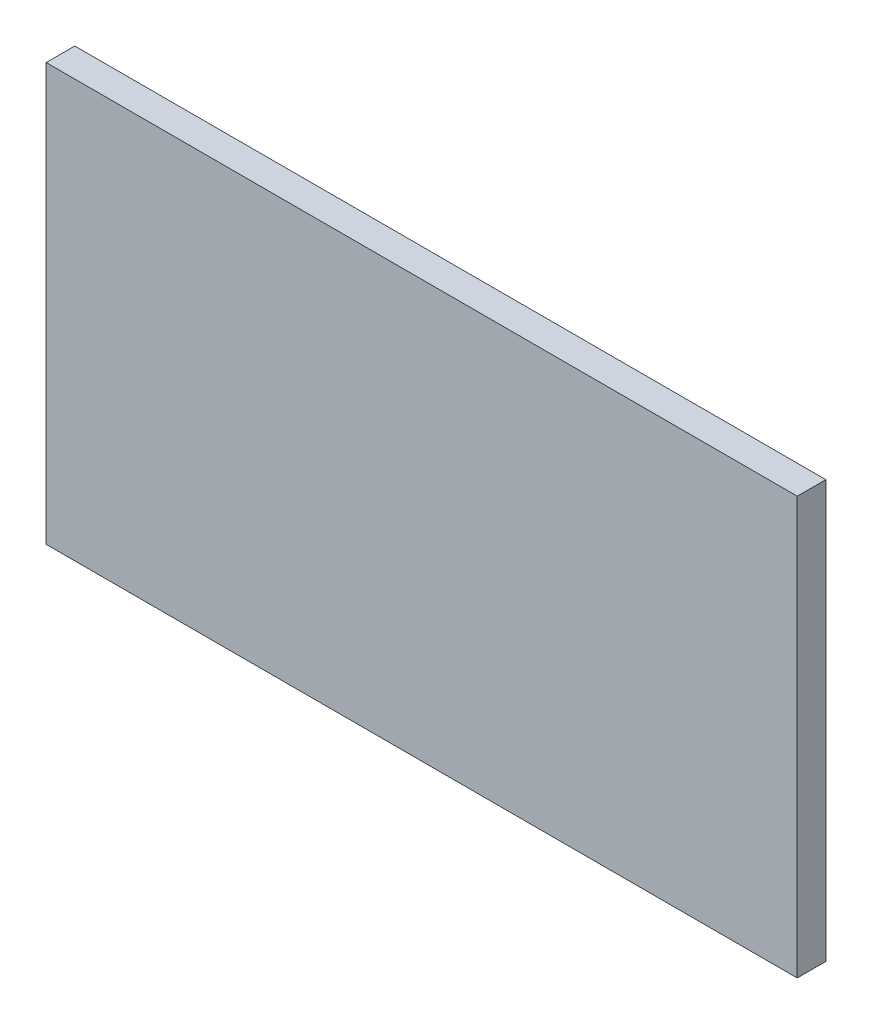
ISO-10303-21;
HEADER;
FILE_DESCRIPTION(('STEP AP214'),'2;1');
FILE_NAME('part.step','',(''),(''),'','','');
FILE_SCHEMA(('AUTOMOTIVE_DESIGN { 1 0 10303 214 1 1 1 1 }'));
ENDSEC;
DATA;
#1=APPLICATION_CONTEXT('core data for automotive mechanical design processes');
#2=APPLICATION_PROTOCOL_DEFINITION('international standard','automotive_design',2000,#1);
#3=PRODUCT_CONTEXT('',#1,'mechanical');
#4=PRODUCT('Part','Part','',(#3));
#5=PRODUCT_RELATED_PRODUCT_CATEGORY('part','',(#4));
#6=PRODUCT_DEFINITION_FORMATION('','',#4);
#7=PRODUCT_DEFINITION_CONTEXT('part definition',#1,'design');
#8=PRODUCT_DEFINITION('design','',#6,#7);
#9=PRODUCT_DEFINITION_SHAPE('','',#8);
#10=(LENGTH_UNIT() NAMED_UNIT(*) SI_UNIT(.MILLI.,.METRE.));
#11=(NAMED_UNIT(*) PLANE_ANGLE_UNIT() SI_UNIT($,.RADIAN.));
#12=(NAMED_UNIT(*) SI_UNIT($,.STERADIAN.) SOLID_ANGLE_UNIT());
#13=UNCERTAINTY_MEASURE_WITH_UNIT(LENGTH_MEASURE(1.E-05),#10,'distance_accuracy_value','');
#14=(GEOMETRIC_REPRESENTATION_CONTEXT(3) GLOBAL_UNCERTAINTY_ASSIGNED_CONTEXT((#13)) GLOBAL_UNIT_ASSIGNED_CONTEXT((#10,
#11,#12)) REPRESENTATION_CONTEXT('',''));
#15=CARTESIAN_POINT('',(0.,0.,0.));
#16=DIRECTION('',(0.,0.,1.));
#17=DIRECTION('',(1.,0.,0.));
#18=AXIS2_PLACEMENT_3D('',#15,#16,#17);
#19=CARTESIAN_POINT('',(12.50008,9.6,0.));
#20=DIRECTION('',(0.,0.,-1.));
#21=DIRECTION('',(-1.,0.,0.));
#22=AXIS2_PLACEMENT_3D('',#19,#20,#21);
#23=PLANE('',#22);
#24=DIRECTION('',(1.,0.,0.));
#25=VECTOR('',#24,1.);
#26=CARTESIAN_POINT('',(12.05008,9.85,0.));
#27=LINE('',#26,#25);
#28=CARTESIAN_POINT('',(12.05008,9.85,0.));
#29=VERTEX_POINT('',#28);
#30=CARTESIAN_POINT('',(12.95008,9.85,0.));
#31=VERTEX_POINT('',#30);
#32=EDGE_CURVE('E55',#29,#31,#27,.T.);
#33=ORIENTED_EDGE('',*,*,#32,.T.);
#34=DIRECTION('',(0.,1.,0.));
#35=VECTOR('',#34,1.);
#36=CARTESIAN_POINT('',(12.95008,9.85,0.));
#37=LINE('',#36,#35);
#38=CARTESIAN_POINT('',(12.95008,9.35,0.));
#39=VERTEX_POINT('',#38);
#40=EDGE_CURVE('E57',#31,#39,#37,.F.);
#41=ORIENTED_EDGE('',*,*,#40,.T.);
#42=DIRECTION('',(1.,0.,0.));
#43=VECTOR('',#42,1.);
#44=CARTESIAN_POINT('',(12.95008,9.35,0.));
#45=LINE('',#44,#43);
#46=CARTESIAN_POINT('',(12.05008,9.35,0.));
#47=VERTEX_POINT('',#46);
#48=EDGE_CURVE('E20',#39,#47,#45,.F.);
#49=ORIENTED_EDGE('',*,*,#48,.T.);
#50=DIRECTION('',(0.,1.,0.));
#51=VECTOR('',#50,1.);
#52=CARTESIAN_POINT('',(12.05008,9.35,0.));
#53=LINE('',#52,#51);
#54=EDGE_CURVE('E80',#47,#29,#53,.T.);
#55=ORIENTED_EDGE('',*,*,#54,.T.);
#56=EDGE_LOOP('',(#33,#41,#49,#55));
#57=FACE_BOUND('',#56,.T.);
#58=ADVANCED_FACE('F17',(#57),#23,.T.);
#59=CARTESIAN_POINT('',(12.95008,9.35,0.));
#60=DIRECTION('',(0.,1.,0.));
#61=DIRECTION('',(0.,0.,1.));
#62=AXIS2_PLACEMENT_3D('',#59,#60,#61);
#63=PLANE('',#62);
#64=DIRECTION('',(0.,0.,-1.));
#65=VECTOR('',#64,1.);
#66=CARTESIAN_POINT('',(12.05008,9.35,0.));
#67=LINE('',#66,#65);
#68=CARTESIAN_POINT('',(12.05008,9.35,0.03429));
#69=VERTEX_POINT('',#68);
#70=EDGE_CURVE('E68',#69,#47,#67,.T.);
#71=ORIENTED_EDGE('',*,*,#70,.T.);
#72=ORIENTED_EDGE('',*,*,#48,.F.);
#73=DIRECTION('',(0.,0.,1.));
#74=VECTOR('',#73,1.);
#75=CARTESIAN_POINT('',(12.95008,9.35,0.));
#76=LINE('',#75,#74);
#77=CARTESIAN_POINT('',(12.95008,9.35,0.03429));
#78=VERTEX_POINT('',#77);
#79=EDGE_CURVE('E63',#39,#78,#76,.T.);
#80=ORIENTED_EDGE('',*,*,#79,.T.);
#81=DIRECTION('',(1.,0.,0.));
#82=VECTOR('',#81,1.);
#83=CARTESIAN_POINT('',(12.50008,9.35,0.03429));
#84=LINE('',#83,#82);
#85=EDGE_CURVE('E83',#69,#78,#84,.T.);
#86=ORIENTED_EDGE('',*,*,#85,.F.);
#87=EDGE_LOOP('',(#71,#72,#80,#86));
#88=FACE_BOUND('',#87,.T.);
#89=ADVANCED_FACE('F65',(#88),#63,.F.);
#90=CARTESIAN_POINT('',(12.95008,9.85,0.));
#91=DIRECTION('',(-1.,0.,0.));
#92=DIRECTION('',(0.,0.,1.));
#93=AXIS2_PLACEMENT_3D('',#90,#91,#92);
#94=PLANE('',#93);
#95=ORIENTED_EDGE('',*,*,#79,.F.);
#96=ORIENTED_EDGE('',*,*,#40,.F.);
#97=DIRECTION('',(0.,0.,-1.));
#98=VECTOR('',#97,1.);
#99=CARTESIAN_POINT('',(12.95008,9.85,0.));
#100=LINE('',#99,#98);
#101=CARTESIAN_POINT('',(12.95008,9.85,0.03429));
#102=VERTEX_POINT('',#101);
#103=EDGE_CURVE('E75',#31,#102,#100,.F.);
#104=ORIENTED_EDGE('',*,*,#103,.T.);
#105=DIRECTION('',(0.,1.,0.));
#106=VECTOR('',#105,1.);
#107=CARTESIAN_POINT('',(12.95008,9.6,0.03429));
#108=LINE('',#107,#106);
#109=EDGE_CURVE('E72',#78,#102,#108,.T.);
#110=ORIENTED_EDGE('',*,*,#109,.F.);
#111=EDGE_LOOP('',(#95,#96,#104,#110));
#112=FACE_BOUND('',#111,.T.);
#113=ADVANCED_FACE('F70',(#112),#94,.F.);
#114=CARTESIAN_POINT('',(12.05008,9.85,0.));
#115=DIRECTION('',(0.,-1.,0.));
#116=DIRECTION('',(0.,0.,-1.));
#117=AXIS2_PLACEMENT_3D('',#114,#115,#116);
#118=PLANE('',#117);
#119=ORIENTED_EDGE('',*,*,#103,.F.);
#120=ORIENTED_EDGE('',*,*,#32,.F.);
#121=DIRECTION('',(0.,0.,-1.));
#122=VECTOR('',#121,1.);
#123=CARTESIAN_POINT('',(12.05008,9.85,0.));
#124=LINE('',#123,#122);
#125=CARTESIAN_POINT('',(12.05008,9.85,0.03429));
#126=VERTEX_POINT('',#125);
#127=EDGE_CURVE('E35',#29,#126,#124,.F.);
#128=ORIENTED_EDGE('',*,*,#127,.T.);
#129=DIRECTION('',(1.,0.,0.));
#130=VECTOR('',#129,1.);
#131=CARTESIAN_POINT('',(12.50008,9.85,0.03429));
#132=LINE('',#131,#130);
#133=EDGE_CURVE('E26',#102,#126,#132,.F.);
#134=ORIENTED_EDGE('',*,*,#133,.F.);
#135=EDGE_LOOP('',(#119,#120,#128,#134));
#136=FACE_BOUND('',#135,.T.);
#137=ADVANCED_FACE('F89',(#136),#118,.F.);
#138=CARTESIAN_POINT('',(12.05008,9.35,0.));
#139=DIRECTION('',(1.,0.,0.));
#140=DIRECTION('',(0.,0.,-1.));
#141=AXIS2_PLACEMENT_3D('',#138,#139,#140);
#142=PLANE('',#141);
#143=ORIENTED_EDGE('',*,*,#127,.F.);
#144=ORIENTED_EDGE('',*,*,#54,.F.);
#145=ORIENTED_EDGE('',*,*,#70,.F.);
#146=DIRECTION('',(0.,1.,0.));
#147=VECTOR('',#146,1.);
#148=CARTESIAN_POINT('',(12.05008,9.6,0.03429));
#149=LINE('',#148,#147);
#150=EDGE_CURVE('E11',#126,#69,#149,.F.);
#151=ORIENTED_EDGE('',*,*,#150,.F.);
#152=EDGE_LOOP('',(#143,#144,#145,#151));
#153=FACE_BOUND('',#152,.T.);
#154=ADVANCED_FACE('F91',(#153),#142,.F.);
#155=CARTESIAN_POINT('',(12.50008,9.6,0.03429));
#156=DIRECTION('',(0.,0.,1.));
#157=DIRECTION('',(1.,0.,0.));
#158=AXIS2_PLACEMENT_3D('',#155,#156,#157);
#159=PLANE('',#158);
#160=ORIENTED_EDGE('',*,*,#133,.T.);
#161=ORIENTED_EDGE('',*,*,#150,.T.);
#162=ORIENTED_EDGE('',*,*,#85,.T.);
#163=ORIENTED_EDGE('',*,*,#109,.T.);
#164=EDGE_LOOP('',(#160,#161,#162,#163));
#165=FACE_BOUND('',#164,.T.);
#166=ADVANCED_FACE('F88',(#165),#159,.T.);
#167=CLOSED_SHELL('',(#58,#89,#113,#137,#154,#166));
#168=MANIFOLD_SOLID_BREP('B1',#167);
#169=ADVANCED_BREP_SHAPE_REPRESENTATION('',(#18,#168),#14);
#170=SHAPE_DEFINITION_REPRESENTATION(#9,#169);
ENDSEC;
END-ISO-10303-21;
